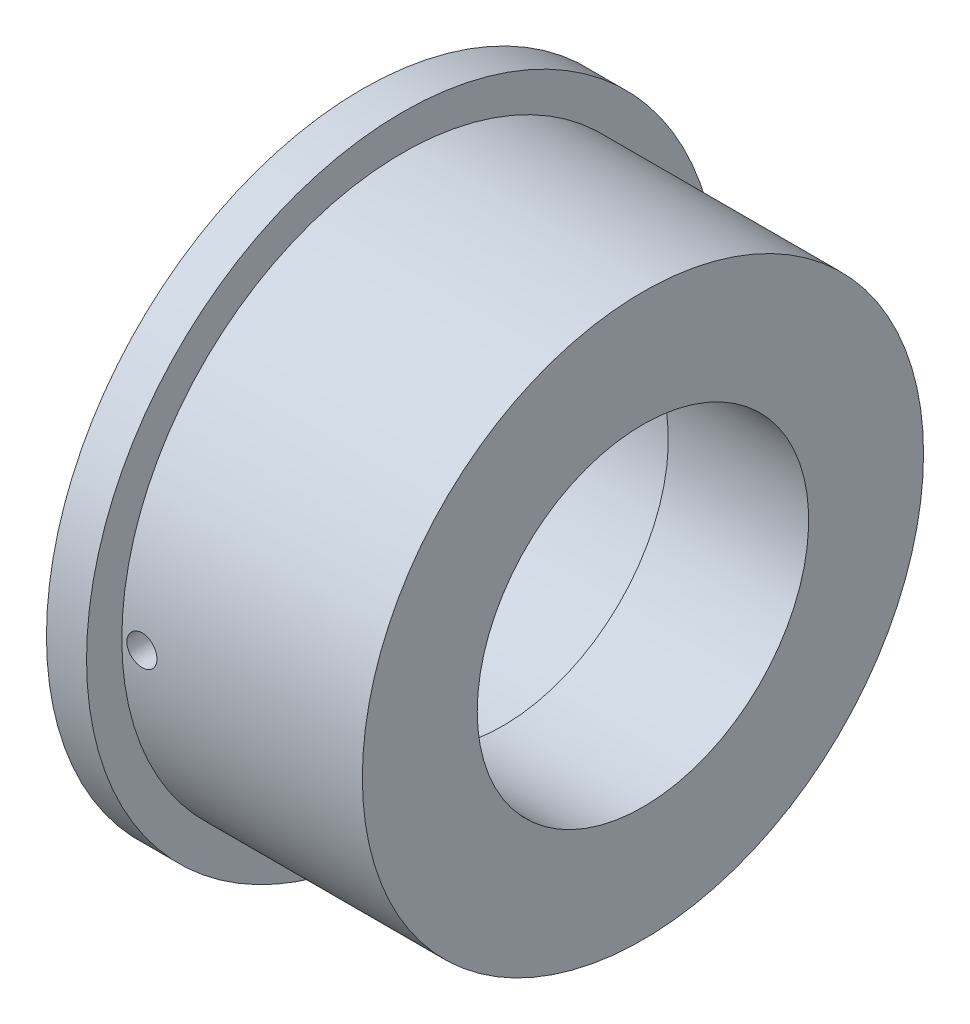
ISO-10303-21;
HEADER;
FILE_DESCRIPTION(('STEP AP214'),'2;1');
FILE_NAME('part.step','',(''),(''),'','','');
FILE_SCHEMA(('AUTOMOTIVE_DESIGN { 1 0 10303 214 1 1 1 1 }'));
ENDSEC;
DATA;
#1=APPLICATION_CONTEXT('core data for automotive mechanical design processes');
#2=APPLICATION_PROTOCOL_DEFINITION('international standard','automotive_design',2000,#1);
#3=PRODUCT_CONTEXT('',#1,'mechanical');
#4=PRODUCT('Part','Part','',(#3));
#5=PRODUCT_RELATED_PRODUCT_CATEGORY('part','',(#4));
#6=PRODUCT_DEFINITION_FORMATION('','',#4);
#7=PRODUCT_DEFINITION_CONTEXT('part definition',#1,'design');
#8=PRODUCT_DEFINITION('design','',#6,#7);
#9=PRODUCT_DEFINITION_SHAPE('','',#8);
#10=(LENGTH_UNIT() NAMED_UNIT(*) SI_UNIT(.MILLI.,.METRE.));
#11=(NAMED_UNIT(*) PLANE_ANGLE_UNIT() SI_UNIT($,.RADIAN.));
#12=(NAMED_UNIT(*) SI_UNIT($,.STERADIAN.) SOLID_ANGLE_UNIT());
#13=UNCERTAINTY_MEASURE_WITH_UNIT(LENGTH_MEASURE(1.E-05),#10,'distance_accuracy_value','');
#14=(GEOMETRIC_REPRESENTATION_CONTEXT(3) GLOBAL_UNCERTAINTY_ASSIGNED_CONTEXT((#13)) GLOBAL_UNIT_ASSIGNED_CONTEXT((#10,
#11,#12)) REPRESENTATION_CONTEXT('',''));
#15=CARTESIAN_POINT('',(0.,0.,0.));
#16=DIRECTION('',(0.,0.,1.));
#17=DIRECTION('',(1.,0.,0.));
#18=AXIS2_PLACEMENT_3D('',#15,#16,#17);
#19=CARTESIAN_POINT('',(-44.45,0.,0.));
#20=DIRECTION('',(-1.,0.,0.));
#21=DIRECTION('',(0.,0.,1.));
#22=AXIS2_PLACEMENT_3D('',#19,#20,#21);
#23=CYLINDRICAL_SURFACE('',#22,44.45);
#24=CARTESIAN_POINT('',(-37.30625,0.,-44.45));
#25=CARTESIAN_POINT('',(-37.306244106041,-0.133653006651336,-44.4499991480647));
#26=CARTESIAN_POINT('',(-37.2949598397623,-0.267400480507652,-44.4493907412567));
#27=CARTESIAN_POINT('',(-37.2501052038379,-0.531204901305172,-44.4470221760507));
#28=CARTESIAN_POINT('',(-37.2165086599552,-0.661257326566379,-44.4452606649961));
#29=CARTESIAN_POINT('',(-37.1279949444128,-0.913812072872785,-44.4407852386706));
#30=CARTESIAN_POINT('',(-37.0730887387961,-1.0363182397441,-44.4380718133277));
#31=CARTESIAN_POINT('',(-36.94353138333,-1.27034233507233,-44.4319980470234));
#32=CARTESIAN_POINT('',(-36.8688848578719,-1.38186282865943,-44.4286378576239));
#33=CARTESIAN_POINT('',(-36.7018716914621,-1.59090977724273,-44.4216442076788));
#34=CARTESIAN_POINT('',(-36.6094874281983,-1.68842214541645,-44.4180104775736));
#35=CARTESIAN_POINT('',(-36.4096568083933,-1.86656464186372,-44.4108816069592));
#36=CARTESIAN_POINT('',(-36.3022098332101,-1.94719407639736,-44.4073864721499));
#37=CARTESIAN_POINT('',(-36.0752279260725,-2.08932232128021,-44.4009269641264));
#38=CARTESIAN_POINT('',(-35.955685947623,-2.15080989363802,-44.3979629031319));
#39=CARTESIAN_POINT('',(-35.7079569299198,-2.25283697716616,-44.3929031488335));
#40=CARTESIAN_POINT('',(-35.5797699634626,-2.29337666470694,-44.3908074482184));
#41=CARTESIAN_POINT('',(-35.3185214135828,-2.35231934942304,-44.3877232251768));
#42=CARTESIAN_POINT('',(-35.185464674954,-2.3707437629802,-44.3867336316627));
#43=CARTESIAN_POINT('',(-34.9181435981051,-2.38499898593299,-44.38597000485));
#44=CARTESIAN_POINT('',(-34.7838792705152,-2.38082999402138,-44.3861959608616));
#45=CARTESIAN_POINT('',(-34.5180999506237,-2.35003456697018,-44.3878369570856));
#46=CARTESIAN_POINT('',(-34.3865822675536,-2.32343128008753,-44.3892507716309));
#47=CARTESIAN_POINT('',(-34.1298820556177,-2.24855831401993,-44.3931062097917));
#48=CARTESIAN_POINT('',(-34.0046995564754,-2.20028853319023,-44.3955478382291));
#49=CARTESIAN_POINT('',(-33.7641486596296,-2.083426385818,-44.4011851336309));
#50=CARTESIAN_POINT('',(-33.6487853917361,-2.01482347961208,-44.404381191478));
#51=CARTESIAN_POINT('',(-33.431203795919,-1.85925013216889,-44.4111667360524));
#52=CARTESIAN_POINT('',(-33.3289855752552,-1.77227954107178,-44.4147562259895));
#53=CARTESIAN_POINT('',(-33.1404609571879,-1.58230903740444,-44.4219295261751));
#54=CARTESIAN_POINT('',(-33.0541747539825,-1.47928908256741,-44.4255133235839));
#55=CARTESIAN_POINT('',(-32.9001191708298,-1.2602145998076,-44.4322669749524));
#56=CARTESIAN_POINT('',(-32.8323497958909,-1.14416006835928,-44.4354368288001));
#57=CARTESIAN_POINT('',(-32.717253468662,-0.902298865448934,-44.4410055270405));
#58=CARTESIAN_POINT('',(-32.6699272368919,-0.776491850444343,-44.4434043442572));
#59=CARTESIAN_POINT('',(-32.5970738895768,-0.518702179505178,-44.4471602417947));
#60=CARTESIAN_POINT('',(-32.5715465868101,-0.386719576620406,-44.4485173310623));
#61=CARTESIAN_POINT('',(-32.5430406482422,-0.12050051654473,-44.4500356819924));
#62=CARTESIAN_POINT('',(-32.5400340833012,0.013732942007026,-44.4501984248209));
#63=CARTESIAN_POINT('',(-32.55658205658,0.280797410185014,-44.4493136766058));
#64=CARTESIAN_POINT('',(-32.5761365089448,0.413628425146242,-44.4482661901676));
#65=CARTESIAN_POINT('',(-32.6372283191362,0.674039050814122,-44.4450799019658));
#66=CARTESIAN_POINT('',(-32.6787529083486,0.801621665419126,-44.4429417341108));
#67=CARTESIAN_POINT('',(-32.7825933108709,1.0480064708409,-44.43781476448));
#68=CARTESIAN_POINT('',(-32.8449092616756,1.16680860358538,-44.4348259570789));
#69=CARTESIAN_POINT('',(-32.9886348650383,1.39238824019505,-44.428330140177));
#70=CARTESIAN_POINT('',(-33.0700632214772,1.49915381229185,-44.4248226243069));
#71=CARTESIAN_POINT('',(-33.2496748840984,1.69750963680295,-44.4176860233286));
#72=CARTESIAN_POINT('',(-33.3478583128333,1.78909977820919,-44.4140569373313));
#73=CARTESIAN_POINT('',(-33.5583132938614,1.95459901560324,-44.4070819846118));
#74=CARTESIAN_POINT('',(-33.6705990774914,2.02849002846349,-44.4037364097874));
#75=CARTESIAN_POINT('',(-33.905999583221,2.15636989757077,-44.3977103544414));
#76=CARTESIAN_POINT('',(-34.0291142529893,2.21035884998885,-44.3950298707061));
#77=CARTESIAN_POINT('',(-34.2826110120538,2.29687057561991,-44.3906383584122));
#78=CARTESIAN_POINT('',(-34.4129891710027,2.32940483815253,-44.388926811043));
#79=CARTESIAN_POINT('',(-34.6773668432174,2.37212121887116,-44.3866647260695));
#80=CARTESIAN_POINT('',(-34.8113663318813,2.38230348886898,-44.38611418058));
#81=CARTESIAN_POINT('',(-35.0790029722924,2.3800254158877,-44.386236376362));
#82=CARTESIAN_POINT('',(-35.2126403677671,2.36759351476778,-44.3869075810381));
#83=CARTESIAN_POINT('',(-35.4759276735763,2.32049883607576,-44.3893943814466));
#84=CARTESIAN_POINT('',(-35.6055775763998,2.28583601663113,-44.3912099793345));
#85=CARTESIAN_POINT('',(-35.8572150619965,2.1952694446962,-44.3957805871013));
#86=CARTESIAN_POINT('',(-35.9792026134249,2.13936560532063,-44.3985356008229));
#87=CARTESIAN_POINT('',(-36.2120628770272,2.00790845763157,-44.4046744643408));
#88=CARTESIAN_POINT('',(-36.3229359160869,1.93235572744112,-44.4080582956347));
#89=CARTESIAN_POINT('',(-36.5305627171846,1.76364241046159,-44.4150783171195));
#90=CARTESIAN_POINT('',(-36.6273001444644,1.67046173403725,-44.4187147922135));
#91=CARTESIAN_POINT('',(-36.8037902008385,1.46915578860373,-44.4258281004212));
#92=CARTESIAN_POINT('',(-36.8835386517474,1.36102685405004,-44.4293048940992));
#93=CARTESIAN_POINT('',(-37.023829868871,1.13279891630671,-44.4357097799733));
#94=CARTESIAN_POINT('',(-37.0843527499573,1.01268768733892,-44.4386373027828));
#95=CARTESIAN_POINT('',(-37.1843004041808,0.764082028782335,-44.4436055218138));
#96=CARTESIAN_POINT('',(-37.2237500420864,0.635597680646737,-44.4456472626514));
#97=CARTESIAN_POINT('',(-37.2701084620936,0.421931861885018,-44.4480751309977));
#98=CARTESIAN_POINT('',(-37.283644177428,0.338133618508708,-44.4487937752493));
#99=CARTESIAN_POINT('',(-37.3017168118116,0.169569593601955,-44.4497564797954));
#100=CARTESIAN_POINT('',(-37.3062537397602,0.0848038130284544,-44.4500005405592));
#101=CARTESIAN_POINT('',(-37.30625,0.,-44.45));
#102=B_SPLINE_CURVE_WITH_KNOTS('',3,(#24,#25,#26,#27,#28,#29,#30,#31,#32,#33,#34,#35,#36,#37,
#38,#39,#40,#41,#42,#43,#44,#45,#46,#47,#48,#49,#50,#51,#52,#53,#54,#55,#56,#57,#58,#59,#60,#61,
#62,#63,#64,#65,#66,#67,#68,#69,#70,#71,#72,#73,#74,#75,#76,#77,#78,#79,#80,#81,#82,#83,#84,#85,
#86,#87,#88,#89,#90,#91,#92,#93,#94,#95,#96,#97,#98,#99,#100,#101),.UNSPECIFIED.,.T.,.F.,(4,2,2,
2,2,2,2,2,2,2,2,2,2,2,2,2,2,2,2,2,2,2,2,2,2,2,2,2,2,2,2,2,2,2,2,2,2,2,4),(0.,0.40064944951767,
0.801769727741889,1.20268386087007,1.60350415843935,2.00472474806218,2.40596182108433,
2.80743401397651,3.20890282662374,3.60998254329757,4.01105873276923,4.41172158761798,
4.81238632212929,5.21325910526817,5.61413515920863,6.01551589598168,6.41689674131858,
6.81829173219278,7.2196832756192,7.62057694994527,8.02146909869366,8.42212851227744,
8.82279057550299,9.22384638366981,9.62490512542499,10.0263718959657,10.4278367265068,
10.8290863914317,11.2303333311133,11.6310759711065,12.0318193659115,12.432564399954,
12.833297644337,13.2344903647558,13.6357816389267,14.0374866298568,14.4387165876637,
14.6929318534464,14.9471468678193),.UNSPECIFIED.);
#103=CARTESIAN_POINT('',(-37.30625,0.,-44.45));
#104=VERTEX_POINT('',#103);
#105=EDGE_CURVE('E71',#104,#104,#102,.T.);
#106=ORIENTED_EDGE('',*,*,#105,.T.);
#107=EDGE_LOOP('',(#106));
#108=FACE_BOUND('',#107,.T.);
#109=CARTESIAN_POINT('',(0.,0.,0.));
#110=DIRECTION('',(-1.,0.,0.));
#111=DIRECTION('',(0.,0.,1.));
#112=AXIS2_PLACEMENT_3D('',#109,#110,#111);
#113=CIRCLE('',#112,44.45);
#114=CARTESIAN_POINT('',(0.,0.,44.45));
#115=VERTEX_POINT('',#114);
#116=EDGE_CURVE('E103',#115,#115,#113,.T.);
#117=ORIENTED_EDGE('',*,*,#116,.T.);
#118=EDGE_LOOP('',(#117));
#119=FACE_BOUND('',#118,.T.);
#120=CARTESIAN_POINT('',(-38.1,0.,0.));
#121=DIRECTION('',(-1.,0.,0.));
#122=DIRECTION('',(0.,0.,1.));
#123=AXIS2_PLACEMENT_3D('',#120,#121,#122);
#124=CIRCLE('',#123,44.45);
#125=CARTESIAN_POINT('',(-38.1,0.,44.45));
#126=VERTEX_POINT('',#125);
#127=EDGE_CURVE('E49',#126,#126,#124,.T.);
#128=ORIENTED_EDGE('',*,*,#127,.F.);
#129=EDGE_LOOP('',(#128));
#130=FACE_BOUND('',#129,.T.);
#131=CARTESIAN_POINT('',(-32.54375,0.,44.45));
#132=CARTESIAN_POINT('',(-32.543755893959,-0.133653006651336,44.4499991480647));
#133=CARTESIAN_POINT('',(-32.5550401602377,-0.267400480507652,44.4493907412567));
#134=CARTESIAN_POINT('',(-32.5998947961621,-0.531204901305172,44.4470221760507));
#135=CARTESIAN_POINT('',(-32.6334913400448,-0.661257326566379,44.4452606649961));
#136=CARTESIAN_POINT('',(-32.7220050555872,-0.913812072872785,44.4407852386706));
#137=CARTESIAN_POINT('',(-32.7769112612039,-1.0363182397441,44.4380718133277));
#138=CARTESIAN_POINT('',(-32.90646861667,-1.27034233507233,44.4319980470234));
#139=CARTESIAN_POINT('',(-32.9811151421281,-1.38186282865943,44.4286378576239));
#140=CARTESIAN_POINT('',(-33.1481283085379,-1.59090977724273,44.4216442076788));
#141=CARTESIAN_POINT('',(-33.2405125718017,-1.68842214541645,44.4180104775736));
#142=CARTESIAN_POINT('',(-33.4403431916067,-1.86656464186372,44.4108816069592));
#143=CARTESIAN_POINT('',(-33.5477901667899,-1.94719407639736,44.4073864721499));
#144=CARTESIAN_POINT('',(-33.7747720739275,-2.08932232128021,44.4009269641264));
#145=CARTESIAN_POINT('',(-33.894314052377,-2.15080989363802,44.3979629031319));
#146=CARTESIAN_POINT('',(-34.1420430700802,-2.25283697716616,44.3929031488335));
#147=CARTESIAN_POINT('',(-34.2702300365374,-2.29337666470694,44.3908074482184));
#148=CARTESIAN_POINT('',(-34.5314785864172,-2.35231934942304,44.3877232251768));
#149=CARTESIAN_POINT('',(-34.664535325046,-2.3707437629802,44.3867336316627));
#150=CARTESIAN_POINT('',(-34.9318564018949,-2.38499898593299,44.38597000485));
#151=CARTESIAN_POINT('',(-35.0661207294848,-2.38082999402138,44.3861959608616));
#152=CARTESIAN_POINT('',(-35.3319000493764,-2.35003456697018,44.3878369570856));
#153=CARTESIAN_POINT('',(-35.4634177324464,-2.32343128008753,44.3892507716309));
#154=CARTESIAN_POINT('',(-35.7201179443823,-2.24855831401992,44.3931062097917));
#155=CARTESIAN_POINT('',(-35.8453004435246,-2.20028853319023,44.3955478382291));
#156=CARTESIAN_POINT('',(-36.0858513403704,-2.083426385818,44.4011851336309));
#157=CARTESIAN_POINT('',(-36.2012146082639,-2.01482347961208,44.404381191478));
#158=CARTESIAN_POINT('',(-36.418796204081,-1.85925013216889,44.4111667360524));
#159=CARTESIAN_POINT('',(-36.5210144247448,-1.77227954107178,44.4147562259895));
#160=CARTESIAN_POINT('',(-36.7095390428121,-1.58230903740444,44.4219295261751));
#161=CARTESIAN_POINT('',(-36.7958252460175,-1.47928908256741,44.4255133235839));
#162=CARTESIAN_POINT('',(-36.9498808291702,-1.2602145998076,44.4322669749524));
#163=CARTESIAN_POINT('',(-37.0176502041091,-1.14416006835928,44.4354368288001));
#164=CARTESIAN_POINT('',(-37.132746531338,-0.902298865448934,44.4410055270405));
#165=CARTESIAN_POINT('',(-37.1800727631081,-0.776491850444343,44.4434043442572));
#166=CARTESIAN_POINT('',(-37.2529261104232,-0.518702179505178,44.4471602417947));
#167=CARTESIAN_POINT('',(-37.2784534131899,-0.386719576620406,44.4485173310623));
#168=CARTESIAN_POINT('',(-37.3069593517578,-0.12050051654473,44.4500356819924));
#169=CARTESIAN_POINT('',(-37.3099659166988,0.013732942007026,44.4501984248209));
#170=CARTESIAN_POINT('',(-37.29341794342,0.280797410185014,44.4493136766058));
#171=CARTESIAN_POINT('',(-37.2738634910552,0.413628425146242,44.4482661901676));
#172=CARTESIAN_POINT('',(-37.2127716808638,0.674039050814122,44.4450799019658));
#173=CARTESIAN_POINT('',(-37.1712470916514,0.801621665419126,44.4429417341108));
#174=CARTESIAN_POINT('',(-37.0674066891291,1.0480064708409,44.43781476448));
#175=CARTESIAN_POINT('',(-37.0050907383244,1.16680860358538,44.4348259570789));
#176=CARTESIAN_POINT('',(-36.8613651349617,1.39238824019505,44.428330140177));
#177=CARTESIAN_POINT('',(-36.7799367785228,1.49915381229185,44.4248226243069));
#178=CARTESIAN_POINT('',(-36.6003251159016,1.69750963680295,44.4176860233286));
#179=CARTESIAN_POINT('',(-36.5021416871667,1.78909977820919,44.4140569373313));
#180=CARTESIAN_POINT('',(-36.2916867061386,1.95459901560324,44.4070819846118));
#181=CARTESIAN_POINT('',(-36.1794009225085,2.02849002846349,44.4037364097874));
#182=CARTESIAN_POINT('',(-35.944000416779,2.15636989757077,44.3977103544414));
#183=CARTESIAN_POINT('',(-35.8208857470106,2.21035884998885,44.3950298707061));
#184=CARTESIAN_POINT('',(-35.5673889879462,2.29687057561991,44.3906383584122));
#185=CARTESIAN_POINT('',(-35.4370108289972,2.32940483815253,44.388926811043));
#186=CARTESIAN_POINT('',(-35.1726331567826,2.37212121887116,44.3866647260695));
#187=CARTESIAN_POINT('',(-35.0386336681187,2.38230348886898,44.38611418058));
#188=CARTESIAN_POINT('',(-34.7709970277076,2.3800254158877,44.386236376362));
#189=CARTESIAN_POINT('',(-34.6373596322329,2.36759351476778,44.3869075810381));
#190=CARTESIAN_POINT('',(-34.3740723264237,2.32049883607576,44.3893943814466));
#191=CARTESIAN_POINT('',(-34.2444224236002,2.28583601663113,44.3912099793345));
#192=CARTESIAN_POINT('',(-33.9927849380035,2.1952694446962,44.3957805871013));
#193=CARTESIAN_POINT('',(-33.8707973865751,2.13936560532063,44.3985356008229));
#194=CARTESIAN_POINT('',(-33.6379371229728,2.00790845763157,44.4046744643408));
#195=CARTESIAN_POINT('',(-33.5270640839131,1.93235572744112,44.4080582956347));
#196=CARTESIAN_POINT('',(-33.3194372828154,1.76364241046159,44.4150783171195));
#197=CARTESIAN_POINT('',(-33.2226998555356,1.67046173403725,44.4187147922135));
#198=CARTESIAN_POINT('',(-33.0462097991615,1.46915578860373,44.4258281004212));
#199=CARTESIAN_POINT('',(-32.9664613482526,1.36102685405004,44.4293048940992));
#200=CARTESIAN_POINT('',(-32.826170131129,1.13279891630671,44.4357097799733));
#201=CARTESIAN_POINT('',(-32.7656472500427,1.01268768733892,44.4386373027828));
#202=CARTESIAN_POINT('',(-32.6656995958192,0.764082028782335,44.4436055218138));
#203=CARTESIAN_POINT('',(-32.6262499579136,0.635597680646737,44.4456472626514));
#204=CARTESIAN_POINT('',(-32.5798915379064,0.421931861885018,44.4480751309977));
#205=CARTESIAN_POINT('',(-32.566355822572,0.338133618508709,44.4487937752493));
#206=CARTESIAN_POINT('',(-32.5482831881884,0.169569593601956,44.4497564797954));
#207=CARTESIAN_POINT('',(-32.5437462602398,0.0848038130284546,44.4500005405592));
#208=CARTESIAN_POINT('',(-32.54375,0.,44.45));
#209=B_SPLINE_CURVE_WITH_KNOTS('',3,(#131,#132,#133,#134,#135,#136,#137,#138,#139,#140,#141,
#142,#143,#144,#145,#146,#147,#148,#149,#150,#151,#152,#153,#154,#155,#156,#157,#158,#159,#160,
#161,#162,#163,#164,#165,#166,#167,#168,#169,#170,#171,#172,#173,#174,#175,#176,#177,#178,#179,
#180,#181,#182,#183,#184,#185,#186,#187,#188,#189,#190,#191,#192,#193,#194,#195,#196,#197,#198,
#199,#200,#201,#202,#203,#204,#205,#206,#207,#208),.UNSPECIFIED.,.T.,.F.,(4,2,2,2,2,2,2,2,2,2,2,
2,2,2,2,2,2,2,2,2,2,2,2,2,2,2,2,2,2,2,2,2,2,2,2,2,2,2,4),(0.,0.40064944951767,0.801769727741889,
1.20268386087007,1.60350415843935,2.00472474806218,2.40596182108433,2.80743401397651,
3.20890282662374,3.60998254329757,4.01105873276923,4.41172158761799,4.81238632212929,
5.21325910526817,5.61413515920863,6.01551589598168,6.41689674131858,6.81829173219278,
7.2196832756192,7.62057694994527,8.02146909869366,8.42212851227744,8.82279057550299,
9.22384638366981,9.62490512542499,10.0263718959657,10.4278367265068,10.8290863914317,
11.2303333311133,11.6310759711065,12.0318193659115,12.432564399954,12.833297644337,
13.2344903647558,13.6357816389267,14.0374866298568,14.4387165876637,14.6929318534464,
14.9471468678193),.UNSPECIFIED.);
#210=CARTESIAN_POINT('',(-32.54375,0.,44.45));
#211=VERTEX_POINT('',#210);
#212=EDGE_CURVE('E76',#211,#211,#209,.T.);
#213=ORIENTED_EDGE('',*,*,#212,.T.);
#214=EDGE_LOOP('',(#213));
#215=FACE_BOUND('',#214,.T.);
#216=ADVANCED_FACE('F32',(#108,#119,#130,#215),#23,.T.);
#217=CARTESIAN_POINT('',(-22.225,0.,0.));
#218=DIRECTION('',(-1.,0.,0.));
#219=DIRECTION('',(0.,0.,1.));
#220=AXIS2_PLACEMENT_3D('',#217,#218,#219);
#221=CONICAL_SURFACE('',#220,30.099,0.00857121866814476);
#222=CARTESIAN_POINT('',(-36.8878548548045,-1.34816630334326,30.1945992890821));
#223=CARTESIAN_POINT('',(-36.8120559391255,-1.45851516845047,30.1890215689994));
#224=CARTESIAN_POINT('',(-36.7268872900564,-1.56252029046183,30.1830372422711));
#225=CARTESIAN_POINT('',(-36.5402246065905,-1.75482090453715,30.1708668065133));
#226=CARTESIAN_POINT('',(-36.4387116466461,-1.8430979318963,30.1646804702726));
#227=CARTESIAN_POINT('',(-36.2223126978748,-2.00131989068783,30.1527377185845));
#228=CARTESIAN_POINT('',(-36.107432404744,-2.07127258893724,30.1469811217331));
#229=CARTESIAN_POINT('',(-35.8675435572359,-2.19087281109296,30.1364644852895));
#230=CARTESIAN_POINT('',(-35.7425375706233,-2.2405254636741,30.1317041941358));
#231=CARTESIAN_POINT('',(-35.4860389981542,-2.31808538980097,30.1236319038705));
#232=CARTESIAN_POINT('',(-35.3545528592214,-2.34601382964868,30.1203184964179));
#233=CARTESIAN_POINT('',(-35.0887217310098,-2.3793889585358,30.1154149209543));
#234=CARTESIAN_POINT('',(-34.9543766864205,-2.38483521222067,30.1138247863138));
#235=CARTESIAN_POINT('',(-34.6870747369049,-2.37309647078598,30.1124537690567));
#236=CARTESIAN_POINT('',(-34.5541148783053,-2.35597925675112,30.1126674780637));
#237=CARTESIAN_POINT('',(-34.2929544368535,-2.29972007754915,30.1147709285643));
#238=CARTESIAN_POINT('',(-34.1647538387252,-2.26057818308262,30.1166606646777));
#239=CARTESIAN_POINT('',(-33.9167777267919,-2.16140391178653,30.1218090838141));
#240=CARTESIAN_POINT('',(-33.7969999024715,-2.10137729109094,30.1250673896906));
#241=CARTESIAN_POINT('',(-33.5692017864977,-1.96213746834319,30.1324995117474));
#242=CARTESIAN_POINT('',(-33.4611816675196,-1.88292398456527,30.1366733413705));
#243=CARTESIAN_POINT('',(-33.2596819328509,-1.70732833938652,30.1454011089771));
#244=CARTESIAN_POINT('',(-33.1662388017026,-1.61090435426833,30.149955958229));
#245=CARTESIAN_POINT('',(-32.9968486081374,-1.40374020231259,30.1588570105899));
#246=CARTESIAN_POINT('',(-32.9209016887064,-1.29299991848819,30.1632032119934));
#247=CARTESIAN_POINT('',(-32.7885783695054,-1.06018959460819,30.1711482243274));
#248=CARTESIAN_POINT('',(-32.7322247471174,-0.938106575971977,30.1747461634576));
#249=CARTESIAN_POINT('',(-32.6408238905994,-0.686181806602163,30.180741764911));
#250=CARTESIAN_POINT('',(-32.6057763753521,-0.556340158262407,30.1831394430705));
#251=CARTESIAN_POINT('',(-32.5580400678625,-0.292830012535052,30.1864355547696));
#252=CARTESIAN_POINT('',(-32.5453115886312,-0.159168738233859,30.1873366493346));
#253=CARTESIAN_POINT('',(-32.5424590706979,0.108395153963555,30.1875371781655));
#254=CARTESIAN_POINT('',(-32.5523348007221,0.2422977693765,30.1868366288186));
#255=CARTESIAN_POINT('',(-32.5943711901276,0.506322132001078,30.1839223039947));
#256=CARTESIAN_POINT('',(-32.6264965998565,0.636449520938311,30.1817109221695));
#257=CARTESIAN_POINT('',(-32.712073762663,0.889462952328553,30.1760486505126));
#258=CARTESIAN_POINT('',(-32.7655257148915,1.01234892714774,30.1725977491061));
#259=CARTESIAN_POINT('',(-32.892316440254,1.2475667533807,30.1648764744476));
#260=CARTESIAN_POINT('',(-32.9656804553694,1.35988496327912,30.1606050630797));
#261=CARTESIAN_POINT('',(-33.1301900890426,1.570630056423,30.151777625772));
#262=CARTESIAN_POINT('',(-33.2213359583196,1.66905674376805,30.1472215958196));
#263=CARTESIAN_POINT('',(-33.4190418853105,1.84942757948687,30.1383932602813));
#264=CARTESIAN_POINT('',(-33.5256323697189,1.93133841067646,30.1341215396239));
#265=CARTESIAN_POINT('',(-33.75107964398,2.07610406421478,30.1264316844113));
#266=CARTESIAN_POINT('',(-33.8699363635839,2.13895899568865,30.1230135449681));
#267=CARTESIAN_POINT('',(-34.116455458047,2.24377654481296,30.1175067199464));
#268=CARTESIAN_POINT('',(-34.2441111843304,2.28575474420077,30.1154170425203));
#269=CARTESIAN_POINT('',(-34.5046737298119,2.34768151679422,30.1128932772508));
#270=CARTESIAN_POINT('',(-34.6375804552362,2.36763048322001,30.1124591598553));
#271=CARTESIAN_POINT('',(-34.9045091293333,2.38490542302474,30.1133911029561));
#272=CARTESIAN_POINT('',(-35.0385273826952,2.38228879528385,30.1147525885977));
#273=CARTESIAN_POINT('',(-35.3042033283394,2.3546535409077,30.1192099907927));
#274=CARTESIAN_POINT('',(-35.4358610265234,2.32963497028925,30.1223059030091));
#275=CARTESIAN_POINT('',(-35.6930610594409,2.25793132880611,30.1299759232698));
#276=CARTESIAN_POINT('',(-35.8186046515697,2.21125073380933,30.1345497258889));
#277=CARTESIAN_POINT('',(-36.0600766375812,2.09756099067863,30.1447508476481));
#278=CARTESIAN_POINT('',(-36.1760048284711,2.030551413514,30.1503781890215));
#279=CARTESIAN_POINT('',(-36.3953116960837,1.8778808509142,30.1621553000802));
#280=CARTESIAN_POINT('',(-36.498653823655,1.79216747260977,30.16830650709));
#281=CARTESIAN_POINT('',(-36.6895002025285,1.60461540939561,30.180500744731));
#282=CARTESIAN_POINT('',(-36.7770042300597,1.50277649669188,30.1865437738328));
#283=CARTESIAN_POINT('',(-36.9338394828694,1.2856445845876,30.1979161772826));
#284=CARTESIAN_POINT('',(-37.0031388857218,1.17032852819561,30.2032442940876));
#285=CARTESIAN_POINT('',(-37.1213785232319,0.929649369470613,30.2126234630238));
#286=CARTESIAN_POINT('',(-37.1703198034163,0.804286783488991,30.2166745807349));
#287=CARTESIAN_POINT('',(-37.246344965656,0.547371171533699,30.223070381531));
#288=CARTESIAN_POINT('',(-37.2734786049659,0.41583296671989,30.2254189480223));
#289=CARTESIAN_POINT('',(-37.3052867631842,0.150015371935474,30.2281794875897));
#290=CARTESIAN_POINT('',(-37.3099565040807,0.0157354048980709,30.2285910486695));
#291=CARTESIAN_POINT('',(-37.2967126798658,-0.251329557552867,30.2274356400343));
#292=CARTESIAN_POINT('',(-37.2788584523407,-0.384117555094183,30.2258738688877));
#293=CARTESIAN_POINT('',(-37.2211907137146,-0.644691983569355,30.2209434063354));
#294=CARTESIAN_POINT('',(-37.1814020384417,-0.772483896511237,30.2175767586649));
#295=CARTESIAN_POINT('',(-37.0989884834917,-0.975451535116906,30.2108530606876));
#296=CARTESIAN_POINT('',(-37.0624192211871,-1.05315875934077,30.2079195197615));
#297=CARTESIAN_POINT('',(-36.9811335635418,-1.20416737830357,30.2015793810912));
#298=CARTESIAN_POINT('',(-36.9364171679876,-1.27746877292703,30.1981727833344));
#299=CARTESIAN_POINT('',(-36.8878548548045,-1.34816630334326,30.1945992890821));
#300=B_SPLINE_CURVE_WITH_KNOTS('',3,(#222,#223,#224,#225,#226,#227,#228,#229,#230,#231,#232,
#233,#234,#235,#236,#237,#238,#239,#240,#241,#242,#243,#244,#245,#246,#247,#248,#249,#250,#251,
#252,#253,#254,#255,#256,#257,#258,#259,#260,#261,#262,#263,#264,#265,#266,#267,#268,#269,#270,
#271,#272,#273,#274,#275,#276,#277,#278,#279,#280,#281,#282,#283,#284,#285,#286,#287,#288,#289,
#290,#291,#292,#293,#294,#295,#296,#297,#298,#299),.UNSPECIFIED.,.T.,.F.,(4,2,2,2,2,2,2,2,2,2,2,
2,2,2,2,2,2,2,2,2,2,2,2,2,2,2,2,2,2,2,2,2,2,2,2,2,2,2,4),(0.,0.401658672461706,
0.803785826873822,1.20574226179263,1.60759708217855,2.00905987584565,2.41053044357116,
2.81079773027331,3.21106373210012,3.61121950207877,4.0113811480061,4.41252881665588,
4.81367976352489,5.21529550480957,5.61690594697549,6.01780153146647,6.41869301423321,
6.81895082240212,7.21921236833206,7.61998370415246,8.02076069114741,8.42233824417335,
8.82391349748987,9.22518857613551,9.62645649193543,10.0267040259051,10.4269505590454,
10.8271144289285,11.2272867446122,11.6285947467886,12.0299084184644,12.4319190037485,
12.8339089405337,13.2349790549864,13.6361344722237,14.0362352812043,14.4358839937375,
14.6932158243949,14.9505476617973),.UNSPECIFIED.);
#301=CARTESIAN_POINT('',(-36.8878548548045,-1.34816630334326,30.1945992890821));
#302=VERTEX_POINT('',#301);
#303=EDGE_CURVE('E52',#302,#302,#300,.T.);
#304=ORIENTED_EDGE('',*,*,#303,.T.);
#305=EDGE_LOOP('',(#304));
#306=FACE_BOUND('',#305,.T.);
#307=CARTESIAN_POINT('',(-44.45,0.,0.));
#308=DIRECTION('',(-1.,0.,0.));
#309=DIRECTION('',(0.,0.,1.));
#310=AXIS2_PLACEMENT_3D('',#307,#308,#309);
#311=CIRCLE('',#310,30.2895);
#312=CARTESIAN_POINT('',(-44.45,0.,30.2895));
#313=VERTEX_POINT('',#312);
#314=EDGE_CURVE('E115',#313,#313,#311,.T.);
#315=ORIENTED_EDGE('',*,*,#314,.T.);
#316=EDGE_LOOP('',(#315));
#317=FACE_BOUND('',#316,.T.);
#318=CARTESIAN_POINT('',(-22.225,0.,0.));
#319=DIRECTION('',(-1.,0.,0.));
#320=DIRECTION('',(0.,0.,1.));
#321=AXIS2_PLACEMENT_3D('',#318,#319,#320);
#322=CIRCLE('',#321,30.099);
#323=CARTESIAN_POINT('',(-22.225,0.,30.099));
#324=VERTEX_POINT('',#323);
#325=EDGE_CURVE('E113',#324,#324,#322,.T.);
#326=ORIENTED_EDGE('',*,*,#325,.F.);
#327=EDGE_LOOP('',(#326));
#328=FACE_BOUND('',#327,.T.);
#329=CARTESIAN_POINT('',(-36.8878548548045,-1.34816630334326,-30.1945992890821));
#330=CARTESIAN_POINT('',(-36.9634070085517,-1.23815659274715,-30.2001585719429));
#331=CARTESIAN_POINT('',(-37.0297511409882,-1.12169307223052,-30.2053210138133));
#332=CARTESIAN_POINT('',(-37.1420521262107,-0.879162452166957,-30.2143162322745));
#333=CARTESIAN_POINT('',(-37.187986429428,-0.753084909900163,-30.21814753716));
#334=CARTESIAN_POINT('',(-37.2580645252672,-0.495002378135915,-30.2240768041496));
#335=CARTESIAN_POINT('',(-37.2822151385514,-0.362999257587402,-30.2261753087911));
#336=CARTESIAN_POINT('',(-37.308034174213,-0.0968297353210822,-30.2284209378655));
#337=CARTESIAN_POINT('',(-37.3097079852032,0.0373361401728403,-30.2285685300121));
#338=CARTESIAN_POINT('',(-37.2905605346267,0.303772803350899,-30.2269000286779));
#339=CARTESIAN_POINT('',(-37.2697837606944,0.436046814531951,-30.2250878186965));
#340=CARTESIAN_POINT('',(-37.2064058700663,0.695224925734911,-30.2196941267285));
#341=CARTESIAN_POINT('',(-37.16380384292,0.822128801500068,-30.216112570933));
#342=CARTESIAN_POINT('',(-37.0579590177598,1.06707625634658,-30.2075472567974));
#343=CARTESIAN_POINT('',(-36.9947006275638,1.18511305918683,-30.2025624396172));
#344=CARTESIAN_POINT('',(-36.8493501374296,1.40891175501437,-30.1917035975307));
#345=CARTESIAN_POINT('',(-36.7672576586218,1.51467340100816,-30.1858295547374));
#346=CARTESIAN_POINT('',(-36.5862428068212,1.71129791602463,-30.1737687875972));
#347=CARTESIAN_POINT('',(-36.4872646246064,1.80210935126232,-30.1675810758085));
#348=CARTESIAN_POINT('',(-36.2754581199653,1.96584134683039,-30.1555355920085));
#349=CARTESIAN_POINT('',(-36.1626297139703,2.03876179920324,-30.1496778219885));
#350=CARTESIAN_POINT('',(-35.9261633862352,2.1647143487044,-30.138865058572));
#351=CARTESIAN_POINT('',(-35.8025133830934,2.21772385851261,-30.1339110937232));
#352=CARTESIAN_POINT('',(-35.5480185670409,2.30221088843359,-30.125386826713));
#353=CARTESIAN_POINT('',(-35.4171738710739,2.33368875841376,-30.1218165020692));
#354=CARTESIAN_POINT('',(-35.1523557337092,2.37414338737738,-30.1163782126666));
#355=CARTESIAN_POINT('',(-35.0183910554337,2.38317693086478,-30.1145059594046));
#356=CARTESIAN_POINT('',(-34.750833125116,2.37863800852625,-30.1125643021944));
#357=CARTESIAN_POINT('',(-34.6172398676167,2.36506587661113,-30.1124948716168));
#358=CARTESIAN_POINT('',(-34.3545306845116,2.3157587701979,-30.1140681179789));
#359=CARTESIAN_POINT('',(-34.2254053970261,2.2800735256062,-30.1157069588336));
#360=CARTESIAN_POINT('',(-33.9749722504047,2.18760510472424,-30.1204123530749));
#361=CARTESIAN_POINT('',(-33.8536644597163,2.13082174373519,-30.1234789189604));
#362=CARTESIAN_POINT('',(-33.6221426634393,1.99769063491207,-30.1306112788647));
#363=CARTESIAN_POINT('',(-33.5119424000612,1.92131905658785,-30.1346782897493));
#364=CARTESIAN_POINT('',(-33.3059017044873,1.75120553498364,-30.1432726840013));
#365=CARTESIAN_POINT('',(-33.2100614998547,1.65746331648461,-30.1478000746623));
#366=CARTESIAN_POINT('',(-33.0352227232696,1.4550004215393,-30.1567491730902));
#367=CARTESIAN_POINT('',(-32.9562654968396,1.34624402314201,-30.1611705983875));
#368=CARTESIAN_POINT('',(-32.8177258767819,1.11699772863345,-30.169341412746));
#369=CARTESIAN_POINT('',(-32.758143441487,0.996507857756771,-30.1730908032524));
#370=CARTESIAN_POINT('',(-32.6600641636123,0.747230201520416,-30.1794514373011));
#371=CARTESIAN_POINT('',(-32.6215630704071,0.618444094785812,-30.1820629102597));
#372=CARTESIAN_POINT('',(-32.5667370155291,0.356214902626207,-30.185826368744));
#373=CARTESIAN_POINT('',(-32.5504117102364,0.222771889394131,-30.1869783768846));
#374=CARTESIAN_POINT('',(-32.5404197787349,-0.0446668064899238,-30.1876803324489));
#375=CARTESIAN_POINT('',(-32.546703012453,-0.178660608697679,-30.1872338249907));
#376=CARTESIAN_POINT('',(-32.5816350213848,-0.443685378111762,-30.1848014264168));
#377=CARTESIAN_POINT('',(-32.6102837528475,-0.574716351113387,-30.1828155383123));
#378=CARTESIAN_POINT('',(-32.6891054773321,-0.830042658382918,-30.177549337087));
#379=CARTESIAN_POINT('',(-32.7392688865025,-0.954340964026408,-30.1742696003716));
#380=CARTESIAN_POINT('',(-32.8596890424246,-1.19276116675001,-30.1668193622327));
#381=CARTESIAN_POINT('',(-32.9299460649071,-1.30688292415628,-30.1626488485861));
#382=CARTESIAN_POINT('',(-33.0887326843358,-1.52196556938762,-30.1539254560366));
#383=CARTESIAN_POINT('',(-33.1772998161671,-1.62289871634148,-30.1493718032705));
#384=CARTESIAN_POINT('',(-33.3701186544083,-1.80848023263913,-30.1404656119949));
#385=CARTESIAN_POINT('',(-33.4743705074147,-1.89312844976003,-30.1361130753656));
#386=CARTESIAN_POINT('',(-33.6957423489014,-2.04382610516272,-30.1281706715864));
#387=CARTESIAN_POINT('',(-33.8128762860093,-2.10985510152053,-30.124581643741));
#388=CARTESIAN_POINT('',(-34.0565996327134,-2.22130301305995,-30.1186641643405));
#389=CARTESIAN_POINT('',(-34.1831889260102,-2.26672218169038,-30.1163356972836));
#390=CARTESIAN_POINT('',(-34.4419701630621,-2.33557844501645,-30.1132990894794));
#391=CARTESIAN_POINT('',(-34.5741509092753,-2.3590574839922,-30.1125878532253));
#392=CARTESIAN_POINT('',(-34.8405697351598,-2.38350913469929,-30.1129531617285));
#393=CARTESIAN_POINT('',(-34.974807709949,-2.38448289000587,-30.1140296156437));
#394=CARTESIAN_POINT('',(-35.2412364251863,-2.36392926717172,-30.1179405967173));
#395=CARTESIAN_POINT('',(-35.3734308822236,-2.34244927955,-30.1207714160154));
#396=CARTESIAN_POINT('',(-35.6323549546228,-2.27767683877817,-30.1279639273805));
#397=CARTESIAN_POINT('',(-35.7590832429813,-2.23437912100676,-30.1323259888593));
#398=CARTESIAN_POINT('',(-36.0036834361996,-2.12712634916045,-30.14218869188));
#399=CARTESIAN_POINT('',(-36.1215390487388,-2.06313438375893,-30.1476913615254));
#400=CARTESIAN_POINT('',(-36.3447470615488,-1.91636976871314,-30.1592921860976));
#401=CARTESIAN_POINT('',(-36.4501131366604,-1.83361795402749,-30.1653896761605));
#402=CARTESIAN_POINT('',(-36.6114355511491,-1.68341154607009,-30.1754505249383));
#403=CARTESIAN_POINT('',(-36.6718300673773,-1.62064830045842,-30.1794184697953));
#404=CARTESIAN_POINT('',(-36.7854064903913,-1.48889357356394,-30.1871802875777));
#405=CARTESIAN_POINT('',(-36.8385883708752,-1.41990206957027,-30.1909741598683));
#406=CARTESIAN_POINT('',(-36.8878548548045,-1.34816630334326,-30.1945992890821));
#407=B_SPLINE_CURVE_WITH_KNOTS('',3,(#329,#330,#331,#332,#333,#334,#335,#336,#337,#338,#339,
#340,#341,#342,#343,#344,#345,#346,#347,#348,#349,#350,#351,#352,#353,#354,#355,#356,#357,#358,
#359,#360,#361,#362,#363,#364,#365,#366,#367,#368,#369,#370,#371,#372,#373,#374,#375,#376,#377,
#378,#379,#380,#381,#382,#383,#384,#385,#386,#387,#388,#389,#390,#391,#392,#393,#394,#395,#396,
#397,#398,#399,#400,#401,#402,#403,#404,#405,#406),.UNSPECIFIED.,.T.,.F.,(4,2,2,2,2,2,2,2,2,2,2,
2,2,2,2,2,2,2,2,2,2,2,2,2,2,2,2,2,2,2,2,2,2,2,2,2,2,2,4),(0.,0.400396653083344,
0.801234586524454,1.20194697051829,1.60256328557573,2.00238720062816,2.40222779587572,
2.8023709058943,3.20252206596258,3.60402234500971,4.00552504672481,4.40748185426878,
4.80943213026555,5.21036442535149,5.61129079827713,6.01131878872627,6.41135028121424,
6.81187076875717,7.21239760265762,7.61389434779889,8.01539022948089,8.41680512781569,
8.81821380604414,9.21873280965625,9.61925102978486,10.0195910214987,10.4199365070617,
10.8211109682731,11.2222891792688,11.6239061414698,12.0255181646631,12.4263608214496,
12.8271831099192,13.2271611339004,13.6272357188846,14.0280278701707,14.4283770578733,
14.6894690633783,14.9505620209729),.UNSPECIFIED.);
#408=CARTESIAN_POINT('',(-36.8878548548045,-1.34816630334326,-30.1945992890821));
#409=VERTEX_POINT('',#408);
#410=EDGE_CURVE('E36',#409,#409,#407,.T.);
#411=ORIENTED_EDGE('',*,*,#410,.T.);
#412=EDGE_LOOP('',(#411));
#413=FACE_BOUND('',#412,.T.);
#414=ADVANCED_FACE('F56',(#306,#317,#328,#413),#221,.F.);
#415=CARTESIAN_POINT('',(-44.45,0.,0.));
#416=DIRECTION('',(-1.,0.,0.));
#417=DIRECTION('',(0.,0.,1.));
#418=AXIS2_PLACEMENT_3D('',#415,#416,#417);
#419=CYLINDRICAL_SURFACE('',#418,50.038);
#420=CARTESIAN_POINT('',(-38.1,0.,0.));
#421=DIRECTION('',(-1.,0.,0.));
#422=DIRECTION('',(0.,0.,1.));
#423=AXIS2_PLACEMENT_3D('',#420,#421,#422);
#424=CIRCLE('',#423,50.038);
#425=CARTESIAN_POINT('',(-38.1,0.,50.038));
#426=VERTEX_POINT('',#425);
#427=EDGE_CURVE('E44',#426,#426,#424,.T.);
#428=ORIENTED_EDGE('',*,*,#427,.T.);
#429=EDGE_LOOP('',(#428));
#430=FACE_BOUND('',#429,.T.);
#431=CARTESIAN_POINT('',(-44.45,0.,0.));
#432=DIRECTION('',(-1.,0.,0.));
#433=DIRECTION('',(0.,0.,1.));
#434=AXIS2_PLACEMENT_3D('',#431,#432,#433);
#435=CIRCLE('',#434,50.038);
#436=CARTESIAN_POINT('',(-44.45,0.,50.038));
#437=VERTEX_POINT('',#436);
#438=EDGE_CURVE('E10',#437,#437,#435,.T.);
#439=ORIENTED_EDGE('',*,*,#438,.F.);
#440=EDGE_LOOP('',(#439));
#441=FACE_BOUND('',#440,.T.);
#442=ADVANCED_FACE('F34',(#430,#441),#419,.T.);
#443=CARTESIAN_POINT('',(-38.1,-50.038,0.));
#444=DIRECTION('',(1.,0.,0.));
#445=DIRECTION('',(0.,0.,-1.));
#446=AXIS2_PLACEMENT_3D('',#443,#444,#445);
#447=PLANE('',#446);
#448=ORIENTED_EDGE('',*,*,#127,.T.);
#449=EDGE_LOOP('',(#448));
#450=FACE_BOUND('',#449,.T.);
#451=ORIENTED_EDGE('',*,*,#427,.F.);
#452=EDGE_LOOP('',(#451));
#453=FACE_BOUND('',#452,.T.);
#454=ADVANCED_FACE('F86',(#450,#453),#447,.T.);
#455=CARTESIAN_POINT('',(0.,-26.2509,0.));
#456=DIRECTION('',(1.,0.,0.));
#457=DIRECTION('',(0.,0.,-1.));
#458=AXIS2_PLACEMENT_3D('',#455,#456,#457);
#459=PLANE('',#458);
#460=CARTESIAN_POINT('',(0.,0.,0.));
#461=DIRECTION('',(-1.,0.,0.));
#462=DIRECTION('',(0.,0.,1.));
#463=AXIS2_PLACEMENT_3D('',#460,#461,#462);
#464=CIRCLE('',#463,26.2509);
#465=CARTESIAN_POINT('',(0.,0.,26.2509));
#466=VERTEX_POINT('',#465);
#467=EDGE_CURVE('E105',#466,#466,#464,.T.);
#468=ORIENTED_EDGE('',*,*,#467,.T.);
#469=EDGE_LOOP('',(#468));
#470=FACE_BOUND('',#469,.T.);
#471=ORIENTED_EDGE('',*,*,#116,.F.);
#472=EDGE_LOOP('',(#471));
#473=FACE_BOUND('',#472,.T.);
#474=ADVANCED_FACE('F84',(#470,#473),#459,.T.);
#475=CARTESIAN_POINT('',(-44.45,0.,0.));
#476=DIRECTION('',(-1.,0.,0.));
#477=DIRECTION('',(0.,0.,1.));
#478=AXIS2_PLACEMENT_3D('',#475,#476,#477);
#479=CYLINDRICAL_SURFACE('',#478,26.2509);
#480=CARTESIAN_POINT('',(-22.225,0.,0.));
#481=DIRECTION('',(-1.,0.,0.));
#482=DIRECTION('',(0.,0.,1.));
#483=AXIS2_PLACEMENT_3D('',#480,#481,#482);
#484=CIRCLE('',#483,26.2509);
#485=CARTESIAN_POINT('',(-22.225,0.,26.2509));
#486=VERTEX_POINT('',#485);
#487=EDGE_CURVE('E110',#486,#486,#484,.T.);
#488=ORIENTED_EDGE('',*,*,#487,.T.);
#489=EDGE_LOOP('',(#488));
#490=FACE_BOUND('',#489,.T.);
#491=ORIENTED_EDGE('',*,*,#467,.F.);
#492=EDGE_LOOP('',(#491));
#493=FACE_BOUND('',#492,.T.);
#494=ADVANCED_FACE('F94',(#490,#493),#479,.F.);
#495=CARTESIAN_POINT('',(-22.225,-26.2509,0.));
#496=DIRECTION('',(-1.,0.,0.));
#497=DIRECTION('',(0.,0.,1.));
#498=AXIS2_PLACEMENT_3D('',#495,#496,#497);
#499=PLANE('',#498);
#500=ORIENTED_EDGE('',*,*,#325,.T.);
#501=EDGE_LOOP('',(#500));
#502=FACE_BOUND('',#501,.T.);
#503=ORIENTED_EDGE('',*,*,#487,.F.);
#504=EDGE_LOOP('',(#503));
#505=FACE_BOUND('',#504,.T.);
#506=ADVANCED_FACE('F163',(#502,#505),#499,.T.);
#507=CARTESIAN_POINT('',(-44.45,-34.3535,0.));
#508=DIRECTION('',(-1.,0.,0.));
#509=DIRECTION('',(0.,0.,1.));
#510=AXIS2_PLACEMENT_3D('',#507,#508,#509);
#511=PLANE('',#510);
#512=ORIENTED_EDGE('',*,*,#438,.T.);
#513=EDGE_LOOP('',(#512));
#514=FACE_BOUND('',#513,.T.);
#515=ORIENTED_EDGE('',*,*,#314,.F.);
#516=EDGE_LOOP('',(#515));
#517=FACE_BOUND('',#516,.T.);
#518=ADVANCED_FACE('F64',(#514,#517),#511,.T.);
#519=CARTESIAN_POINT('',(-34.925,0.,50.038));
#520=DIRECTION('',(0.,0.,-1.));
#521=DIRECTION('',(-1.,0.,0.));
#522=AXIS2_PLACEMENT_3D('',#519,#520,#521);
#523=CYLINDRICAL_SURFACE('',#522,2.38125);
#524=ORIENTED_EDGE('',*,*,#212,.F.);
#525=EDGE_LOOP('',(#524));
#526=FACE_BOUND('',#525,.T.);
#527=ORIENTED_EDGE('',*,*,#303,.F.);
#528=EDGE_LOOP('',(#527));
#529=FACE_BOUND('',#528,.T.);
#530=ADVANCED_FACE('F60',(#526,#529),#523,.F.);
#531=ORIENTED_EDGE('',*,*,#105,.F.);
#532=EDGE_LOOP('',(#531));
#533=FACE_BOUND('',#532,.T.);
#534=ORIENTED_EDGE('',*,*,#410,.F.);
#535=EDGE_LOOP('',(#534));
#536=FACE_BOUND('',#535,.T.);
#537=ADVANCED_FACE('F63',(#533,#536),#523,.F.);
#538=CLOSED_SHELL('',(#216,#414,#442,#454,#474,#494,#506,#518,#530,#537));
#539=MANIFOLD_SOLID_BREP('B2',#538);
#540=ADVANCED_BREP_SHAPE_REPRESENTATION('',(#18,#539),#14);
#541=SHAPE_DEFINITION_REPRESENTATION(#9,#540);
ENDSEC;
END-ISO-10303-21;
